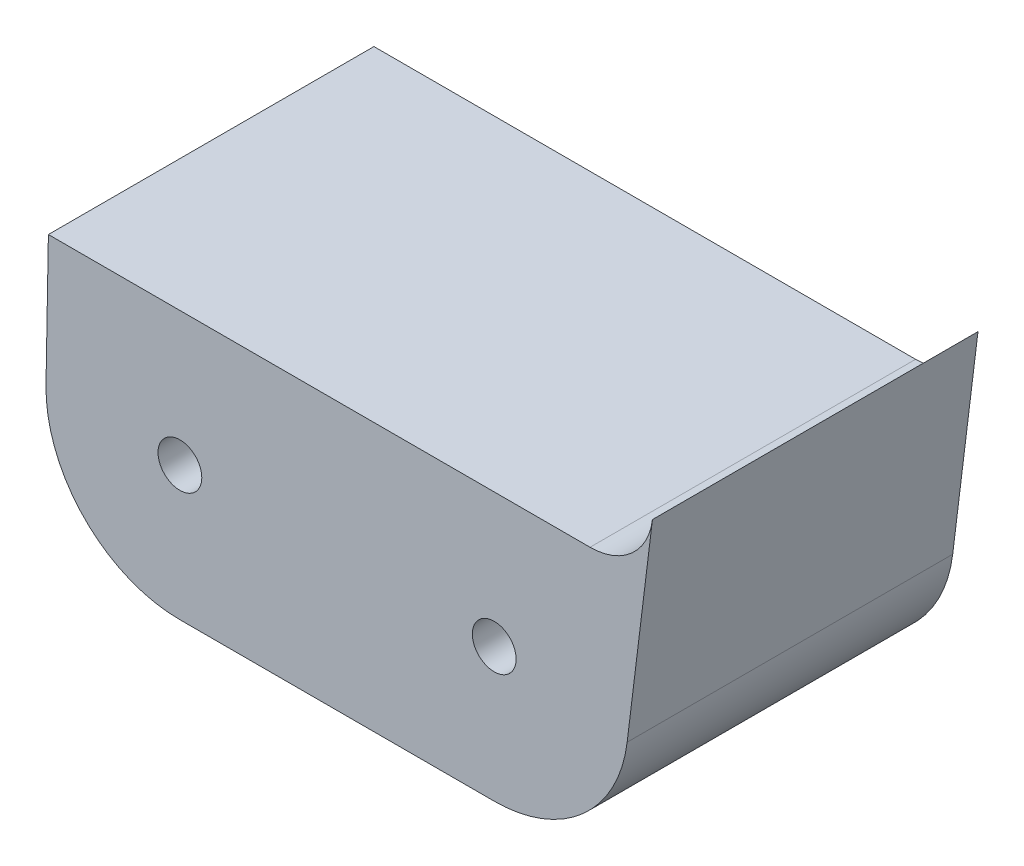
ISO-10303-21;
HEADER;
FILE_DESCRIPTION(('STEP AP214'),'2;1');
FILE_NAME('part.step','',(''),(''),'','','');
FILE_SCHEMA(('AUTOMOTIVE_DESIGN { 1 0 10303 214 1 1 1 1 }'));
ENDSEC;
DATA;
#1=APPLICATION_CONTEXT('core data for automotive mechanical design processes');
#2=APPLICATION_PROTOCOL_DEFINITION('international standard','automotive_design',2000,#1);
#3=PRODUCT_CONTEXT('',#1,'mechanical');
#4=PRODUCT('Part','Part','',(#3));
#5=PRODUCT_RELATED_PRODUCT_CATEGORY('part','',(#4));
#6=PRODUCT_DEFINITION_FORMATION('','',#4);
#7=PRODUCT_DEFINITION_CONTEXT('part definition',#1,'design');
#8=PRODUCT_DEFINITION('design','',#6,#7);
#9=PRODUCT_DEFINITION_SHAPE('','',#8);
#10=(LENGTH_UNIT() NAMED_UNIT(*) SI_UNIT(.MILLI.,.METRE.));
#11=(NAMED_UNIT(*) PLANE_ANGLE_UNIT() SI_UNIT($,.RADIAN.));
#12=(NAMED_UNIT(*) SI_UNIT($,.STERADIAN.) SOLID_ANGLE_UNIT());
#13=UNCERTAINTY_MEASURE_WITH_UNIT(LENGTH_MEASURE(1.E-05),#10,'distance_accuracy_value','');
#14=(GEOMETRIC_REPRESENTATION_CONTEXT(3) GLOBAL_UNCERTAINTY_ASSIGNED_CONTEXT((#13)) GLOBAL_UNIT_ASSIGNED_CONTEXT((#10,
#11,#12)) REPRESENTATION_CONTEXT('',''));
#15=CARTESIAN_POINT('',(0.,0.,0.));
#16=DIRECTION('',(0.,0.,1.));
#17=DIRECTION('',(1.,0.,0.));
#18=AXIS2_PLACEMENT_3D('',#15,#16,#17);
#19=CARTESIAN_POINT('',(-39.4968483661837,0.716680096828893,-17.78));
#20=DIRECTION('',(-0.999835415633958,0.0181422612722439,0.));
#21=DIRECTION('',(-0.0181422612722439,-0.999835415633958,0.));
#22=AXIS2_PLACEMENT_3D('',#19,#20,#21);
#23=PLANE('',#22);
#24=DIRECTION('',(0.,0.,1.));
#25=VECTOR('',#24,1.);
#26=CARTESIAN_POINT('',(-41.8093114826365,-126.725124785238,-17.78));
#27=LINE('',#26,#25);
#28=CARTESIAN_POINT('',(-41.8093114826365,-126.725124785238,-17.78));
#29=VERTEX_POINT('',#28);
#30=CARTESIAN_POINT('',(-41.8093114826365,-126.725124785238,19.05));
#31=VERTEX_POINT('',#30);
#32=EDGE_CURVE('E145',#29,#31,#27,.T.);
#33=ORIENTED_EDGE('',*,*,#32,.T.);
#34=DIRECTION('',(-0.0181422612722453,-0.999835415633958,0.));
#35=VECTOR('',#34,1.);
#36=CARTESIAN_POINT('',(-41.5393786991221,-111.8489,19.05));
#37=LINE('',#36,#35);
#38=CARTESIAN_POINT('',(-41.5393786991221,-111.8489,19.05));
#39=VERTEX_POINT('',#38);
#40=EDGE_CURVE('E220',#39,#31,#37,.T.);
#41=ORIENTED_EDGE('',*,*,#40,.F.);
#42=DIRECTION('',(0.,0.,1.));
#43=VECTOR('',#42,1.);
#44=CARTESIAN_POINT('',(-41.5393786991221,-111.8489,-17.78));
#45=LINE('',#44,#43);
#46=CARTESIAN_POINT('',(-41.5393786991221,-111.8489,-17.78));
#47=VERTEX_POINT('',#46);
#48=EDGE_CURVE('E210',#47,#39,#45,.T.);
#49=ORIENTED_EDGE('',*,*,#48,.F.);
#50=DIRECTION('',(-0.0181422612722439,-0.999835415633958,0.));
#51=VECTOR('',#50,1.);
#52=CARTESIAN_POINT('',(-39.4968483661837,0.716680096828893,-17.78));
#53=LINE('',#52,#51);
#54=EDGE_CURVE('E263',#47,#29,#53,.T.);
#55=ORIENTED_EDGE('',*,*,#54,.T.);
#56=EDGE_LOOP('',(#33,#41,#49,#55));
#57=FACE_BOUND('',#56,.T.);
#58=ADVANCED_FACE('F142',(#57),#23,.T.);
#59=CARTESIAN_POINT('',(0.,0.,-17.78));
#60=DIRECTION('',(0.,0.,1.));
#61=DIRECTION('',(1.,0.,0.));
#62=AXIS2_PLACEMENT_3D('',#59,#60,#61);
#63=PLANE('',#62);
#64=CARTESIAN_POINT('',(8.89929488317508,-127.,-17.78));
#65=DIRECTION('',(0.,0.,1.));
#66=DIRECTION('',(1.,0.,0.));
#67=AXIS2_PLACEMENT_3D('',#64,#65,#66);
#68=CIRCLE('',#67,2.4765);
#69=CARTESIAN_POINT('',(11.3757948831751,-127.,-17.78));
#70=VERTEX_POINT('',#69);
#71=EDGE_CURVE('E251',#70,#70,#68,.T.);
#72=ORIENTED_EDGE('',*,*,#71,.T.);
#73=EDGE_LOOP('',(#72));
#74=FACE_BOUND('',#73,.T.);
#75=CARTESIAN_POINT('',(-26.6607051168249,-127.,-17.78));
#76=DIRECTION('',(0.,0.,1.));
#77=DIRECTION('',(1.,0.,0.));
#78=AXIS2_PLACEMENT_3D('',#75,#76,#77);
#79=CIRCLE('',#78,2.4765);
#80=CARTESIAN_POINT('',(-24.1842051168249,-127.,-17.78));
#81=VERTEX_POINT('',#80);
#82=EDGE_CURVE('E256',#81,#81,#79,.T.);
#83=ORIENTED_EDGE('',*,*,#82,.T.);
#84=EDGE_LOOP('',(#83));
#85=FACE_BOUND('',#84,.T.);
#86=ORIENTED_EDGE('',*,*,#54,.F.);
#87=DIRECTION('',(1.,0.,0.));
#88=VECTOR('',#87,1.);
#89=CARTESIAN_POINT('',(-30.3525262521126,-111.8489,-17.78));
#90=LINE('',#89,#88);
#91=CARTESIAN_POINT('',(19.740240237741,-111.8489,-17.78));
#92=VERTEX_POINT('',#91);
#93=EDGE_CURVE('E246',#47,#92,#90,.T.);
#94=ORIENTED_EDGE('',*,*,#93,.T.);
#95=CARTESIAN_POINT('',(19.740240237741,-104.7369,-17.78));
#96=DIRECTION('',(0.,0.,-1.));
#97=DIRECTION('',(1.,0.,0.));
#98=AXIS2_PLACEMENT_3D('',#95,#96,#97);
#99=CIRCLE('',#98,7.11200000000001);
#100=CARTESIAN_POINT('',(26.798937581656,-105.606000573586,-17.78));
#101=VERTEX_POINT('',#100);
#102=EDGE_CURVE('E208',#101,#92,#99,.T.);
#103=ORIENTED_EDGE('',*,*,#102,.F.);
#104=DIRECTION('',(0.12220199291141,0.992505250831692,0.));
#105=VECTOR('',#104,1.);
#106=CARTESIAN_POINT('',(39.2072823004421,-4.82738809667695,-17.78));
#107=LINE('',#106,#105);
#108=CARTESIAN_POINT('',(23.9368411890512,-128.8514946148,-17.78));
#109=VERTEX_POINT('',#108);
#110=EDGE_CURVE('E275',#109,#101,#107,.T.);
#111=ORIENTED_EDGE('',*,*,#110,.F.);
#112=CARTESIAN_POINT('',(8.89929488317508,-127.,-17.78));
#113=DIRECTION('',(0.,0.,1.));
#114=DIRECTION('',(1.,0.,0.));
#115=AXIS2_PLACEMENT_3D('',#112,#113,#114);
#116=CIRCLE('',#115,15.1511);
#117=CARTESIAN_POINT('',(8.89929488317515,-142.1511,-17.78));
#118=VERTEX_POINT('',#117);
#119=EDGE_CURVE('E272',#118,#109,#116,.T.);
#120=ORIENTED_EDGE('',*,*,#119,.F.);
#121=DIRECTION('',(1.,0.,0.));
#122=VECTOR('',#121,1.);
#123=CARTESIAN_POINT('',(-26.6607051168249,-142.1511,-17.78));
#124=LINE('',#123,#122);
#125=CARTESIAN_POINT('',(-26.6607051168249,-142.1511,-17.78));
#126=VERTEX_POINT('',#125);
#127=EDGE_CURVE('E269',#126,#118,#124,.T.);
#128=ORIENTED_EDGE('',*,*,#127,.F.);
#129=CARTESIAN_POINT('',(-26.6607051168249,-127.,-17.78));
#130=DIRECTION('',(0.,0.,1.));
#131=DIRECTION('',(-1.,0.,0.));
#132=AXIS2_PLACEMENT_3D('',#129,#130,#131);
#133=CIRCLE('',#132,15.1511);
#134=EDGE_CURVE('E265',#29,#126,#133,.T.);
#135=ORIENTED_EDGE('',*,*,#134,.F.);
#136=EDGE_LOOP('',(#86,#94,#103,#111,#120,#128,#135));
#137=FACE_BOUND('',#136,.T.);
#138=ADVANCED_FACE('F300',(#74,#85,#137),#63,.F.);
#139=CARTESIAN_POINT('',(8.89929488317508,-127.,-17.78));
#140=DIRECTION('',(0.,0.,1.));
#141=DIRECTION('',(1.,0.,0.));
#142=AXIS2_PLACEMENT_3D('',#139,#140,#141);
#143=CYLINDRICAL_SURFACE('',#142,15.1511);
#144=DIRECTION('',(0.,0.,1.));
#145=VECTOR('',#144,1.);
#146=CARTESIAN_POINT('',(23.9368411890512,-128.8514946148,-17.78));
#147=LINE('',#146,#145);
#148=CARTESIAN_POINT('',(23.9368411890512,-128.8514946148,19.05));
#149=VERTEX_POINT('',#148);
#150=EDGE_CURVE('E14',#109,#149,#147,.T.);
#151=ORIENTED_EDGE('',*,*,#150,.T.);
#152=CARTESIAN_POINT('',(8.89929488317508,-127.,19.05));
#153=DIRECTION('',(0.,0.,1.));
#154=DIRECTION('',(1.,0.,0.));
#155=AXIS2_PLACEMENT_3D('',#152,#153,#154);
#156=CIRCLE('',#155,15.1511);
#157=CARTESIAN_POINT('',(8.89929488317508,-142.1511,19.05));
#158=VERTEX_POINT('',#157);
#159=EDGE_CURVE('E242',#158,#149,#156,.T.);
#160=ORIENTED_EDGE('',*,*,#159,.F.);
#161=DIRECTION('',(0.,0.,1.));
#162=VECTOR('',#161,1.);
#163=CARTESIAN_POINT('',(8.89929488317515,-142.1511,-17.78));
#164=LINE('',#163,#162);
#165=EDGE_CURVE('E150',#118,#158,#164,.T.);
#166=ORIENTED_EDGE('',*,*,#165,.F.);
#167=ORIENTED_EDGE('',*,*,#119,.T.);
#168=EDGE_LOOP('',(#151,#160,#166,#167));
#169=FACE_BOUND('',#168,.T.);
#170=ADVANCED_FACE('F296',(#169),#143,.T.);
#171=CARTESIAN_POINT('',(-26.6607051168249,-142.1511,-17.78));
#172=DIRECTION('',(0.,-1.,0.));
#173=DIRECTION('',(0.,0.,-1.));
#174=AXIS2_PLACEMENT_3D('',#171,#172,#173);
#175=PLANE('',#174);
#176=ORIENTED_EDGE('',*,*,#165,.T.);
#177=DIRECTION('',(1.,0.,0.));
#178=VECTOR('',#177,1.);
#179=CARTESIAN_POINT('',(-26.6607051168249,-142.1511,19.05));
#180=LINE('',#179,#178);
#181=CARTESIAN_POINT('',(-26.6607051168249,-142.1511,19.05));
#182=VERTEX_POINT('',#181);
#183=EDGE_CURVE('E239',#182,#158,#180,.T.);
#184=ORIENTED_EDGE('',*,*,#183,.F.);
#185=DIRECTION('',(0.,0.,1.));
#186=VECTOR('',#185,1.);
#187=CARTESIAN_POINT('',(-26.6607051168249,-142.1511,-17.78));
#188=LINE('',#187,#186);
#189=EDGE_CURVE('E277',#126,#182,#188,.T.);
#190=ORIENTED_EDGE('',*,*,#189,.F.);
#191=ORIENTED_EDGE('',*,*,#127,.T.);
#192=EDGE_LOOP('',(#176,#184,#190,#191));
#193=FACE_BOUND('',#192,.T.);
#194=ADVANCED_FACE('F288',(#193),#175,.T.);
#195=CARTESIAN_POINT('',(-26.6607051168249,-127.,-17.78));
#196=DIRECTION('',(0.,0.,1.));
#197=DIRECTION('',(1.,0.,0.));
#198=AXIS2_PLACEMENT_3D('',#195,#196,#197);
#199=CYLINDRICAL_SURFACE('',#198,15.1511);
#200=ORIENTED_EDGE('',*,*,#189,.T.);
#201=CARTESIAN_POINT('',(-26.6607051168249,-127.,19.05));
#202=DIRECTION('',(0.,0.,1.));
#203=DIRECTION('',(1.,0.,0.));
#204=AXIS2_PLACEMENT_3D('',#201,#202,#203);
#205=CIRCLE('',#204,15.1511);
#206=EDGE_CURVE('E236',#31,#182,#205,.T.);
#207=ORIENTED_EDGE('',*,*,#206,.F.);
#208=ORIENTED_EDGE('',*,*,#32,.F.);
#209=ORIENTED_EDGE('',*,*,#134,.T.);
#210=EDGE_LOOP('',(#200,#207,#208,#209));
#211=FACE_BOUND('',#210,.T.);
#212=ADVANCED_FACE('F285',(#211),#199,.T.);
#213=CARTESIAN_POINT('',(-26.6607051168249,-127.,-17.78));
#214=DIRECTION('',(0.,0.,1.));
#215=DIRECTION('',(1.,0.,0.));
#216=AXIS2_PLACEMENT_3D('',#213,#214,#215);
#217=CYLINDRICAL_SURFACE('',#216,2.4765);
#218=ORIENTED_EDGE('',*,*,#82,.F.);
#219=EDGE_LOOP('',(#218));
#220=FACE_BOUND('',#219,.T.);
#221=CARTESIAN_POINT('',(-26.6607051168249,-127.,19.05));
#222=DIRECTION('',(0.,0.,1.));
#223=DIRECTION('',(1.,0.,0.));
#224=AXIS2_PLACEMENT_3D('',#221,#222,#223);
#225=CIRCLE('',#224,2.47650000000001);
#226=CARTESIAN_POINT('',(-24.1842051168249,-127.,19.05));
#227=VERTEX_POINT('',#226);
#228=EDGE_CURVE('E227',#227,#227,#225,.T.);
#229=ORIENTED_EDGE('',*,*,#228,.T.);
#230=EDGE_LOOP('',(#229));
#231=FACE_BOUND('',#230,.T.);
#232=ADVANCED_FACE('F287',(#220,#231),#217,.F.);
#233=CARTESIAN_POINT('',(8.89929488317508,-127.,-17.78));
#234=DIRECTION('',(0.,0.,1.));
#235=DIRECTION('',(1.,0.,0.));
#236=AXIS2_PLACEMENT_3D('',#233,#234,#235);
#237=CYLINDRICAL_SURFACE('',#236,2.4765);
#238=ORIENTED_EDGE('',*,*,#71,.F.);
#239=EDGE_LOOP('',(#238));
#240=FACE_BOUND('',#239,.T.);
#241=CARTESIAN_POINT('',(8.89929488317508,-127.,19.05));
#242=DIRECTION('',(0.,0.,1.));
#243=DIRECTION('',(1.,0.,0.));
#244=AXIS2_PLACEMENT_3D('',#241,#242,#243);
#245=CIRCLE('',#244,2.47650000000001);
#246=CARTESIAN_POINT('',(11.3757948831751,-127.,19.05));
#247=VERTEX_POINT('',#246);
#248=EDGE_CURVE('E231',#247,#247,#245,.T.);
#249=ORIENTED_EDGE('',*,*,#248,.T.);
#250=EDGE_LOOP('',(#249));
#251=FACE_BOUND('',#250,.T.);
#252=ADVANCED_FACE('F293',(#240,#251),#237,.F.);
#253=CARTESIAN_POINT('',(-30.3525262521126,-111.8489,-17.78));
#254=DIRECTION('',(0.,-1.,0.));
#255=DIRECTION('',(0.,0.,-1.));
#256=AXIS2_PLACEMENT_3D('',#253,#254,#255);
#257=PLANE('',#256);
#258=ORIENTED_EDGE('',*,*,#48,.T.);
#259=DIRECTION('',(-1.,0.,0.));
#260=VECTOR('',#259,1.);
#261=CARTESIAN_POINT('',(19.740240237741,-111.8489,19.05));
#262=LINE('',#261,#260);
#263=CARTESIAN_POINT('',(19.740240237741,-111.8489,19.05));
#264=VERTEX_POINT('',#263);
#265=EDGE_CURVE('E214',#264,#39,#262,.T.);
#266=ORIENTED_EDGE('',*,*,#265,.F.);
#267=DIRECTION('',(0.,0.,1.));
#268=VECTOR('',#267,1.);
#269=CARTESIAN_POINT('',(19.740240237741,-111.8489,-17.78));
#270=LINE('',#269,#268);
#271=EDGE_CURVE('E202',#92,#264,#270,.T.);
#272=ORIENTED_EDGE('',*,*,#271,.F.);
#273=ORIENTED_EDGE('',*,*,#93,.F.);
#274=EDGE_LOOP('',(#258,#266,#272,#273));
#275=FACE_BOUND('',#274,.T.);
#276=ADVANCED_FACE('F215',(#275),#257,.F.);
#277=CARTESIAN_POINT('',(39.2072823004421,-4.82738809667695,-17.78));
#278=DIRECTION('',(0.992505250831692,-0.12220199291141,0.));
#279=DIRECTION('',(0.12220199291141,0.992505250831692,0.));
#280=AXIS2_PLACEMENT_3D('',#277,#278,#279);
#281=PLANE('',#280);
#282=DIRECTION('',(0.,0.,1.));
#283=VECTOR('',#282,1.);
#284=CARTESIAN_POINT('',(26.798937581656,-105.606000573586,-17.78));
#285=LINE('',#284,#283);
#286=CARTESIAN_POINT('',(26.798937581656,-105.606000573586,19.05));
#287=VERTEX_POINT('',#286);
#288=EDGE_CURVE('E211',#101,#287,#285,.T.);
#289=ORIENTED_EDGE('',*,*,#288,.T.);
#290=DIRECTION('',(0.122201992911411,0.992505250831692,0.));
#291=VECTOR('',#290,1.);
#292=CARTESIAN_POINT('',(23.9368411890512,-128.8514946148,19.05));
#293=LINE('',#292,#291);
#294=EDGE_CURVE('E226',#149,#287,#293,.T.);
#295=ORIENTED_EDGE('',*,*,#294,.F.);
#296=ORIENTED_EDGE('',*,*,#150,.F.);
#297=ORIENTED_EDGE('',*,*,#110,.T.);
#298=EDGE_LOOP('',(#289,#295,#296,#297));
#299=FACE_BOUND('',#298,.T.);
#300=ADVANCED_FACE('F313',(#299),#281,.T.);
#301=CARTESIAN_POINT('',(19.740240237741,-104.7369,-17.78));
#302=DIRECTION('',(0.,0.,1.));
#303=DIRECTION('',(1.,0.,0.));
#304=AXIS2_PLACEMENT_3D('',#301,#302,#303);
#305=CYLINDRICAL_SURFACE('',#304,7.11200000000001);
#306=ORIENTED_EDGE('',*,*,#288,.F.);
#307=ORIENTED_EDGE('',*,*,#102,.T.);
#308=ORIENTED_EDGE('',*,*,#271,.T.);
#309=CARTESIAN_POINT('',(19.740240237741,-104.7369,19.05));
#310=DIRECTION('',(0.,0.,-1.));
#311=DIRECTION('',(1.,0.,0.));
#312=AXIS2_PLACEMENT_3D('',#309,#310,#311);
#313=CIRCLE('',#312,7.11200000000001);
#314=EDGE_CURVE('E206',#287,#264,#313,.T.);
#315=ORIENTED_EDGE('',*,*,#314,.F.);
#316=EDGE_LOOP('',(#306,#307,#308,#315));
#317=FACE_BOUND('',#316,.T.);
#318=ADVANCED_FACE('F204',(#317),#305,.F.);
#319=CARTESIAN_POINT('',(19.740240237741,-104.7369,19.05));
#320=DIRECTION('',(0.,0.,1.));
#321=DIRECTION('',(1.,0.,0.));
#322=AXIS2_PLACEMENT_3D('',#319,#320,#321);
#323=PLANE('',#322);
#324=ORIENTED_EDGE('',*,*,#228,.F.);
#325=EDGE_LOOP('',(#324));
#326=FACE_BOUND('',#325,.T.);
#327=ORIENTED_EDGE('',*,*,#314,.T.);
#328=ORIENTED_EDGE('',*,*,#265,.T.);
#329=ORIENTED_EDGE('',*,*,#40,.T.);
#330=ORIENTED_EDGE('',*,*,#206,.T.);
#331=ORIENTED_EDGE('',*,*,#183,.T.);
#332=ORIENTED_EDGE('',*,*,#159,.T.);
#333=ORIENTED_EDGE('',*,*,#294,.T.);
#334=EDGE_LOOP('',(#327,#328,#329,#330,#331,#332,#333));
#335=FACE_BOUND('',#334,.T.);
#336=ORIENTED_EDGE('',*,*,#248,.F.);
#337=EDGE_LOOP('',(#336));
#338=FACE_BOUND('',#337,.T.);
#339=ADVANCED_FACE('F223',(#326,#335,#338),#323,.T.);
#340=CLOSED_SHELL('',(#58,#138,#170,#194,#212,#232,#252,#276,#300,#318,#339));
#341=MANIFOLD_SOLID_BREP('B2',#340);
#342=ADVANCED_BREP_SHAPE_REPRESENTATION('',(#18,#341),#14);
#343=SHAPE_DEFINITION_REPRESENTATION(#9,#342);
ENDSEC;
END-ISO-10303-21;
